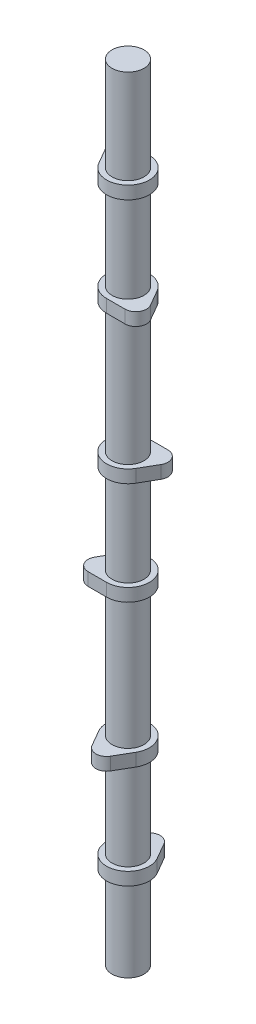
ISO-10303-21;
HEADER;
FILE_DESCRIPTION(('STEP AP214'),'2;1');
FILE_NAME('part.step','',(''),(''),'','','');
FILE_SCHEMA(('AUTOMOTIVE_DESIGN { 1 0 10303 214 1 1 1 1 }'));
ENDSEC;
DATA;
#1=APPLICATION_CONTEXT('core data for automotive mechanical design processes');
#2=APPLICATION_PROTOCOL_DEFINITION('international standard','automotive_design',2000,#1);
#3=PRODUCT_CONTEXT('',#1,'mechanical');
#4=PRODUCT('Part','Part','',(#3));
#5=PRODUCT_RELATED_PRODUCT_CATEGORY('part','',(#4));
#6=PRODUCT_DEFINITION_FORMATION('','',#4);
#7=PRODUCT_DEFINITION_CONTEXT('part definition',#1,'design');
#8=PRODUCT_DEFINITION('design','',#6,#7);
#9=PRODUCT_DEFINITION_SHAPE('','',#8);
#10=(LENGTH_UNIT() NAMED_UNIT(*) SI_UNIT(.MILLI.,.METRE.));
#11=(NAMED_UNIT(*) PLANE_ANGLE_UNIT() SI_UNIT($,.RADIAN.));
#12=(NAMED_UNIT(*) SI_UNIT($,.STERADIAN.) SOLID_ANGLE_UNIT());
#13=UNCERTAINTY_MEASURE_WITH_UNIT(LENGTH_MEASURE(1.E-05),#10,'distance_accuracy_value','');
#14=(GEOMETRIC_REPRESENTATION_CONTEXT(3) GLOBAL_UNCERTAINTY_ASSIGNED_CONTEXT((#13)) GLOBAL_UNIT_ASSIGNED_CONTEXT((#10,
#11,#12)) REPRESENTATION_CONTEXT('',''));
#15=CARTESIAN_POINT('',(0.,0.,0.));
#16=DIRECTION('',(0.,0.,1.));
#17=DIRECTION('',(1.,0.,0.));
#18=AXIS2_PLACEMENT_3D('',#15,#16,#17);
#19=CARTESIAN_POINT('',(-10.9985226280624,356.87,-6.34999999999997));
#20=DIRECTION('',(0.,-1.,0.));
#21=DIRECTION('',(-0.86602540378444,0.,-0.499999999999998));
#22=AXIS2_PLACEMENT_3D('',#19,#20,#21);
#23=CYLINDRICAL_SURFACE('',#22,6.35);
#24=CARTESIAN_POINT('',(-10.9985226280624,349.25,-6.34999999999997));
#25=DIRECTION('',(0.,1.,0.));
#26=DIRECTION('',(0.86602540378444,0.,0.499999999999998));
#27=AXIS2_PLACEMENT_3D('',#24,#25,#26);
#28=CIRCLE('',#27,6.35);
#29=CARTESIAN_POINT('',(-10.9985226280624,349.25,-12.7));
#30=VERTEX_POINT('',#29);
#31=CARTESIAN_POINT('',(-16.4977839420936,349.25,-3.17499999999996));
#32=VERTEX_POINT('',#31);
#33=EDGE_CURVE('E387',#30,#32,#28,.T.);
#34=ORIENTED_EDGE('',*,*,#33,.T.);
#35=DIRECTION('',(0.,-1.,0.));
#36=VECTOR('',#35,1.);
#37=CARTESIAN_POINT('',(-16.4977839420936,356.87,-3.17499999999996));
#38=LINE('',#37,#36);
#39=CARTESIAN_POINT('',(-16.4977839420936,356.87,-3.17499999999996));
#40=VERTEX_POINT('',#39);
#41=EDGE_CURVE('E406',#40,#32,#38,.T.);
#42=ORIENTED_EDGE('',*,*,#41,.F.);
#43=CARTESIAN_POINT('',(-10.9985226280624,356.87,-6.34999999999997));
#44=DIRECTION('',(0.,1.,0.));
#45=DIRECTION('',(0.86602540378444,0.,0.499999999999998));
#46=AXIS2_PLACEMENT_3D('',#43,#44,#45);
#47=CIRCLE('',#46,6.35);
#48=CARTESIAN_POINT('',(-10.9985226280624,356.87,-12.7));
#49=VERTEX_POINT('',#48);
#50=EDGE_CURVE('E388',#49,#40,#47,.T.);
#51=ORIENTED_EDGE('',*,*,#50,.F.);
#52=DIRECTION('',(0.,-1.,0.));
#53=VECTOR('',#52,1.);
#54=CARTESIAN_POINT('',(-10.9985226280624,356.87,-12.7));
#55=LINE('',#54,#53);
#56=EDGE_CURVE('E394',#49,#30,#55,.T.);
#57=ORIENTED_EDGE('',*,*,#56,.T.);
#58=EDGE_LOOP('',(#34,#42,#51,#57));
#59=FACE_BOUND('',#58,.T.);
#60=ADVANCED_FACE('F35',(#59),#23,.T.);
#61=CARTESIAN_POINT('',(-16.4977839420936,356.87,-3.17499999999996));
#62=DIRECTION('',(0.866025403784437,0.,-0.500000000000002));
#63=DIRECTION('',(-0.500000000000002,0.,-0.866025403784437));
#64=AXIS2_PLACEMENT_3D('',#61,#62,#63);
#65=PLANE('',#64);
#66=DIRECTION('',(0.500000000000002,0.,0.866025403784437));
#67=VECTOR('',#66,1.);
#68=CARTESIAN_POINT('',(-16.4977839420936,349.25,-3.17499999999996));
#69=LINE('',#68,#67);
#70=CARTESIAN_POINT('',(-10.9985226280624,349.25,6.35000000000003));
#71=VERTEX_POINT('',#70);
#72=EDGE_CURVE('E397',#32,#71,#69,.T.);
#73=ORIENTED_EDGE('',*,*,#72,.T.);
#74=DIRECTION('',(0.,-1.,0.));
#75=VECTOR('',#74,1.);
#76=CARTESIAN_POINT('',(-10.9985226280624,356.87,6.35000000000003));
#77=LINE('',#76,#75);
#78=CARTESIAN_POINT('',(-10.9985226280624,356.87,6.35000000000003));
#79=VERTEX_POINT('',#78);
#80=EDGE_CURVE('E404',#79,#71,#77,.T.);
#81=ORIENTED_EDGE('',*,*,#80,.F.);
#82=DIRECTION('',(0.500000000000002,0.,0.866025403784437));
#83=VECTOR('',#82,1.);
#84=CARTESIAN_POINT('',(-16.4977839420936,356.87,-3.17499999999996));
#85=LINE('',#84,#83);
#86=EDGE_CURVE('E84',#40,#79,#85,.T.);
#87=ORIENTED_EDGE('',*,*,#86,.F.);
#88=ORIENTED_EDGE('',*,*,#41,.T.);
#89=EDGE_LOOP('',(#73,#81,#87,#88));
#90=FACE_BOUND('',#89,.T.);
#91=ADVANCED_FACE('F425',(#90),#65,.F.);
#92=CARTESIAN_POINT('',(0.,356.87,0.));
#93=DIRECTION('',(0.,-1.,0.));
#94=DIRECTION('',(-0.86602540378444,0.,-0.499999999999998));
#95=AXIS2_PLACEMENT_3D('',#92,#93,#94);
#96=CYLINDRICAL_SURFACE('',#95,12.7);
#97=CARTESIAN_POINT('',(0.,349.25,0.));
#98=DIRECTION('',(0.,1.,0.));
#99=DIRECTION('',(0.86602540378444,0.,0.499999999999998));
#100=AXIS2_PLACEMENT_3D('',#97,#98,#99);
#101=CIRCLE('',#100,12.7);
#102=CARTESIAN_POINT('',(0.,349.25,-12.7));
#103=VERTEX_POINT('',#102);
#104=EDGE_CURVE('E70',#71,#103,#101,.T.);
#105=ORIENTED_EDGE('',*,*,#104,.T.);
#106=DIRECTION('',(0.,-1.,0.));
#107=VECTOR('',#106,1.);
#108=CARTESIAN_POINT('',(0.,356.87,-12.7));
#109=LINE('',#108,#107);
#110=CARTESIAN_POINT('',(0.,356.87,-12.7));
#111=VERTEX_POINT('',#110);
#112=EDGE_CURVE('E402',#111,#103,#109,.T.);
#113=ORIENTED_EDGE('',*,*,#112,.F.);
#114=CARTESIAN_POINT('',(0.,356.87,0.));
#115=DIRECTION('',(0.,1.,0.));
#116=DIRECTION('',(0.86602540378444,0.,0.499999999999998));
#117=AXIS2_PLACEMENT_3D('',#114,#115,#116);
#118=CIRCLE('',#117,12.7);
#119=EDGE_CURVE('E391',#79,#111,#118,.T.);
#120=ORIENTED_EDGE('',*,*,#119,.F.);
#121=ORIENTED_EDGE('',*,*,#80,.T.);
#122=EDGE_LOOP('',(#105,#113,#120,#121));
#123=FACE_BOUND('',#122,.T.);
#124=ADVANCED_FACE('F424',(#123),#96,.T.);
#125=CARTESIAN_POINT('',(-10.9985226280624,356.87,-12.7));
#126=DIRECTION('',(0.,0.,1.));
#127=DIRECTION('',(1.,0.,0.));
#128=AXIS2_PLACEMENT_3D('',#125,#126,#127);
#129=PLANE('',#128);
#130=DIRECTION('',(-1.,0.,0.));
#131=VECTOR('',#130,1.);
#132=CARTESIAN_POINT('',(-10.9985226280624,349.25,-12.7));
#133=LINE('',#132,#131);
#134=EDGE_CURVE('E76',#103,#30,#133,.T.);
#135=ORIENTED_EDGE('',*,*,#134,.T.);
#136=ORIENTED_EDGE('',*,*,#56,.F.);
#137=DIRECTION('',(-1.,0.,0.));
#138=VECTOR('',#137,1.);
#139=CARTESIAN_POINT('',(-10.9985226280624,356.87,-12.7));
#140=LINE('',#139,#138);
#141=EDGE_CURVE('E52',#111,#49,#140,.T.);
#142=ORIENTED_EDGE('',*,*,#141,.F.);
#143=ORIENTED_EDGE('',*,*,#112,.T.);
#144=EDGE_LOOP('',(#135,#136,#142,#143));
#145=FACE_BOUND('',#144,.T.);
#146=ADVANCED_FACE('F422',(#145),#129,.F.);
#147=CARTESIAN_POINT('',(-10.9985226280624,356.87,-6.34999999999997));
#148=DIRECTION('',(0.,1.,0.));
#149=DIRECTION('',(0.86602540378444,0.,0.499999999999998));
#150=AXIS2_PLACEMENT_3D('',#147,#148,#149);
#151=PLANE('',#150);
#152=CARTESIAN_POINT('',(0.,356.87,0.));
#153=DIRECTION('',(0.,1.,0.));
#154=DIRECTION('',(-0.866025403784443,0.,-0.499999999999992));
#155=AXIS2_PLACEMENT_3D('',#152,#153,#154);
#156=CIRCLE('',#155,9.5);
#157=CARTESIAN_POINT('',(-8.22724133595221,356.87,-4.74999999999992));
#158=VERTEX_POINT('',#157);
#159=EDGE_CURVE('E384',#158,#158,#156,.F.);
#160=ORIENTED_EDGE('',*,*,#159,.T.);
#161=EDGE_LOOP('',(#160));
#162=FACE_BOUND('',#161,.T.);
#163=ORIENTED_EDGE('',*,*,#50,.T.);
#164=ORIENTED_EDGE('',*,*,#86,.T.);
#165=ORIENTED_EDGE('',*,*,#119,.T.);
#166=ORIENTED_EDGE('',*,*,#141,.T.);
#167=EDGE_LOOP('',(#163,#164,#165,#166));
#168=FACE_BOUND('',#167,.T.);
#169=ADVANCED_FACE('F416',(#162,#168),#151,.T.);
#170=CARTESIAN_POINT('',(-10.9985226280624,349.25,-6.34999999999997));
#171=DIRECTION('',(0.,1.,0.));
#172=DIRECTION('',(0.86602540378444,0.,0.499999999999998));
#173=AXIS2_PLACEMENT_3D('',#170,#171,#172);
#174=PLANE('',#173);
#175=CARTESIAN_POINT('',(0.,349.25,0.));
#176=DIRECTION('',(0.,1.,0.));
#177=DIRECTION('',(-0.866025403784443,0.,-0.499999999999992));
#178=AXIS2_PLACEMENT_3D('',#175,#176,#177);
#179=CIRCLE('',#178,9.5);
#180=CARTESIAN_POINT('',(-8.22724133595221,349.25,-4.74999999999992));
#181=VERTEX_POINT('',#180);
#182=EDGE_CURVE('E44',#181,#181,#179,.F.);
#183=ORIENTED_EDGE('',*,*,#182,.F.);
#184=EDGE_LOOP('',(#183));
#185=FACE_BOUND('',#184,.T.);
#186=ORIENTED_EDGE('',*,*,#33,.F.);
#187=ORIENTED_EDGE('',*,*,#134,.F.);
#188=ORIENTED_EDGE('',*,*,#104,.F.);
#189=ORIENTED_EDGE('',*,*,#72,.F.);
#190=EDGE_LOOP('',(#186,#187,#188,#189));
#191=FACE_BOUND('',#190,.T.);
#192=ADVANCED_FACE('F413',(#185,#191),#174,.F.);
#193=CARTESIAN_POINT('',(0.,412.75,0.));
#194=DIRECTION('',(0.,-1.,0.));
#195=DIRECTION('',(0.866025403784443,0.,0.499999999999992));
#196=AXIS2_PLACEMENT_3D('',#193,#194,#195);
#197=CYLINDRICAL_SURFACE('',#196,9.5);
#198=CARTESIAN_POINT('',(0.,295.91,0.));
#199=DIRECTION('',(0.,1.,0.));
#200=DIRECTION('',(-0.866025403784443,0.,-0.499999999999992));
#201=AXIS2_PLACEMENT_3D('',#198,#199,#200);
#202=CIRCLE('',#201,9.5);
#203=CARTESIAN_POINT('',(-8.22724133595221,295.91,-4.74999999999992));
#204=VERTEX_POINT('',#203);
#205=EDGE_CURVE('E38',#204,#204,#202,.T.);
#206=ORIENTED_EDGE('',*,*,#205,.T.);
#207=EDGE_LOOP('',(#206));
#208=FACE_BOUND('',#207,.T.);
#209=ORIENTED_EDGE('',*,*,#182,.T.);
#210=EDGE_LOOP('',(#209));
#211=FACE_BOUND('',#210,.T.);
#212=ADVANCED_FACE('F411',(#208,#211),#197,.T.);
#213=ORIENTED_EDGE('',*,*,#159,.F.);
#214=EDGE_LOOP('',(#213));
#215=FACE_BOUND('',#214,.T.);
#216=CARTESIAN_POINT('',(0.,412.75,0.));
#217=DIRECTION('',(0.,1.,0.));
#218=DIRECTION('',(-0.866025403784443,0.,-0.499999999999992));
#219=AXIS2_PLACEMENT_3D('',#216,#217,#218);
#220=CIRCLE('',#219,9.5);
#221=CARTESIAN_POINT('',(-8.22724133595221,412.75,-4.74999999999992));
#222=VERTEX_POINT('',#221);
#223=EDGE_CURVE('E381',#222,#222,#220,.T.);
#224=ORIENTED_EDGE('',*,*,#223,.F.);
#225=EDGE_LOOP('',(#224));
#226=FACE_BOUND('',#225,.T.);
#227=ADVANCED_FACE('F438',(#215,#226),#197,.T.);
#228=CARTESIAN_POINT('',(0.,412.75,0.));
#229=DIRECTION('',(0.,1.,0.));
#230=DIRECTION('',(-0.866025403784443,0.,-0.499999999999992));
#231=AXIS2_PLACEMENT_3D('',#228,#229,#230);
#232=PLANE('',#231);
#233=ORIENTED_EDGE('',*,*,#223,.T.);
#234=EDGE_LOOP('',(#233));
#235=FACE_BOUND('',#234,.T.);
#236=ADVANCED_FACE('F441',(#235),#232,.T.);
#237=CARTESIAN_POINT('',(10.9985226280624,295.91,6.3499999999999));
#238=DIRECTION('',(0.,-1.,0.));
#239=DIRECTION('',(0.866025403784443,0.,0.499999999999992));
#240=AXIS2_PLACEMENT_3D('',#237,#238,#239);
#241=CYLINDRICAL_SURFACE('',#240,6.35);
#242=CARTESIAN_POINT('',(10.9985226280624,288.29,6.3499999999999));
#243=DIRECTION('',(0.,1.,0.));
#244=DIRECTION('',(-0.866025403784443,0.,-0.499999999999992));
#245=AXIS2_PLACEMENT_3D('',#242,#243,#244);
#246=CIRCLE('',#245,6.35);
#247=CARTESIAN_POINT('',(10.9985226280625,288.29,12.6999999999999));
#248=VERTEX_POINT('',#247);
#249=CARTESIAN_POINT('',(16.4977839420936,288.29,3.17499999999985));
#250=VERTEX_POINT('',#249);
#251=EDGE_CURVE('E349',#248,#250,#246,.T.);
#252=ORIENTED_EDGE('',*,*,#251,.T.);
#253=DIRECTION('',(0.,-1.,0.));
#254=VECTOR('',#253,1.);
#255=CARTESIAN_POINT('',(16.4977839420936,295.91,3.17499999999985));
#256=LINE('',#255,#254);
#257=CARTESIAN_POINT('',(16.4977839420936,295.91,3.17499999999985));
#258=VERTEX_POINT('',#257);
#259=EDGE_CURVE('E378',#258,#250,#256,.T.);
#260=ORIENTED_EDGE('',*,*,#259,.F.);
#261=CARTESIAN_POINT('',(10.9985226280624,295.91,6.3499999999999));
#262=DIRECTION('',(0.,1.,0.));
#263=DIRECTION('',(-0.866025403784443,0.,-0.499999999999992));
#264=AXIS2_PLACEMENT_3D('',#261,#262,#263);
#265=CIRCLE('',#264,6.35);
#266=CARTESIAN_POINT('',(10.9985226280625,295.91,12.6999999999999));
#267=VERTEX_POINT('',#266);
#268=EDGE_CURVE('E352',#267,#258,#265,.T.);
#269=ORIENTED_EDGE('',*,*,#268,.F.);
#270=DIRECTION('',(0.,-1.,0.));
#271=VECTOR('',#270,1.);
#272=CARTESIAN_POINT('',(10.9985226280625,295.91,12.6999999999999));
#273=LINE('',#272,#271);
#274=EDGE_CURVE('E362',#267,#248,#273,.T.);
#275=ORIENTED_EDGE('',*,*,#274,.T.);
#276=EDGE_LOOP('',(#252,#260,#269,#275));
#277=FACE_BOUND('',#276,.T.);
#278=ADVANCED_FACE('F446',(#277),#241,.T.);
#279=CARTESIAN_POINT('',(16.4977839420936,295.91,3.17499999999985));
#280=DIRECTION('',(-0.866025403784434,0.,0.500000000000008));
#281=DIRECTION('',(0.500000000000008,0.,0.866025403784434));
#282=AXIS2_PLACEMENT_3D('',#279,#280,#281);
#283=PLANE('',#282);
#284=DIRECTION('',(-0.500000000000008,0.,-0.866025403784434));
#285=VECTOR('',#284,1.);
#286=CARTESIAN_POINT('',(16.4977839420936,288.29,3.17499999999985));
#287=LINE('',#286,#285);
#288=CARTESIAN_POINT('',(10.9985226280623,288.29,-6.35000000000011));
#289=VERTEX_POINT('',#288);
#290=EDGE_CURVE('E365',#250,#289,#287,.T.);
#291=ORIENTED_EDGE('',*,*,#290,.T.);
#292=DIRECTION('',(0.,-1.,0.));
#293=VECTOR('',#292,1.);
#294=CARTESIAN_POINT('',(10.9985226280623,295.91,-6.35000000000011));
#295=LINE('',#294,#293);
#296=CARTESIAN_POINT('',(10.9985226280623,295.91,-6.35000000000011));
#297=VERTEX_POINT('',#296);
#298=EDGE_CURVE('E375',#297,#289,#295,.T.);
#299=ORIENTED_EDGE('',*,*,#298,.F.);
#300=DIRECTION('',(-0.500000000000008,0.,-0.866025403784434));
#301=VECTOR('',#300,1.);
#302=CARTESIAN_POINT('',(16.4977839420936,295.91,3.17499999999985));
#303=LINE('',#302,#301);
#304=EDGE_CURVE('E355',#258,#297,#303,.T.);
#305=ORIENTED_EDGE('',*,*,#304,.F.);
#306=ORIENTED_EDGE('',*,*,#259,.T.);
#307=EDGE_LOOP('',(#291,#299,#305,#306));
#308=FACE_BOUND('',#307,.T.);
#309=ADVANCED_FACE('F450',(#308),#283,.F.);
#310=CARTESIAN_POINT('',(0.,295.91,0.));
#311=DIRECTION('',(0.,-1.,0.));
#312=DIRECTION('',(0.866025403784443,0.,0.499999999999992));
#313=AXIS2_PLACEMENT_3D('',#310,#311,#312);
#314=CYLINDRICAL_SURFACE('',#313,12.7);
#315=CARTESIAN_POINT('',(0.,288.29,0.));
#316=DIRECTION('',(0.,1.,0.));
#317=DIRECTION('',(-0.866025403784443,0.,-0.499999999999992));
#318=AXIS2_PLACEMENT_3D('',#315,#316,#317);
#319=CIRCLE('',#318,12.7);
#320=CARTESIAN_POINT('',(1.16226472890446E-13,288.29,12.7));
#321=VERTEX_POINT('',#320);
#322=EDGE_CURVE('E367',#289,#321,#319,.T.);
#323=ORIENTED_EDGE('',*,*,#322,.T.);
#324=DIRECTION('',(0.,-1.,0.));
#325=VECTOR('',#324,1.);
#326=CARTESIAN_POINT('',(1.16226472890446E-13,295.91,12.7));
#327=LINE('',#326,#325);
#328=CARTESIAN_POINT('',(1.16226472890446E-13,295.91,12.7));
#329=VERTEX_POINT('',#328);
#330=EDGE_CURVE('E372',#329,#321,#327,.T.);
#331=ORIENTED_EDGE('',*,*,#330,.F.);
#332=CARTESIAN_POINT('',(0.,295.91,0.));
#333=DIRECTION('',(0.,1.,0.));
#334=DIRECTION('',(-0.866025403784443,0.,-0.499999999999992));
#335=AXIS2_PLACEMENT_3D('',#332,#333,#334);
#336=CIRCLE('',#335,12.7);
#337=EDGE_CURVE('E358',#297,#329,#336,.T.);
#338=ORIENTED_EDGE('',*,*,#337,.F.);
#339=ORIENTED_EDGE('',*,*,#298,.T.);
#340=EDGE_LOOP('',(#323,#331,#338,#339));
#341=FACE_BOUND('',#340,.T.);
#342=ADVANCED_FACE('F454',(#341),#314,.T.);
#343=CARTESIAN_POINT('',(10.9985226280625,295.91,12.6999999999999));
#344=DIRECTION('',(0.,0.,-1.));
#345=DIRECTION('',(-1.,0.,0.));
#346=AXIS2_PLACEMENT_3D('',#343,#344,#345);
#347=PLANE('',#346);
#348=DIRECTION('',(1.,0.,0.));
#349=VECTOR('',#348,1.);
#350=CARTESIAN_POINT('',(10.9985226280625,288.29,12.6999999999999));
#351=LINE('',#350,#349);
#352=EDGE_CURVE('E356',#321,#248,#351,.T.);
#353=ORIENTED_EDGE('',*,*,#352,.T.);
#354=ORIENTED_EDGE('',*,*,#274,.F.);
#355=DIRECTION('',(1.,0.,0.));
#356=VECTOR('',#355,1.);
#357=CARTESIAN_POINT('',(10.9985226280625,295.91,12.6999999999999));
#358=LINE('',#357,#356);
#359=EDGE_CURVE('E360',#329,#267,#358,.T.);
#360=ORIENTED_EDGE('',*,*,#359,.F.);
#361=ORIENTED_EDGE('',*,*,#330,.T.);
#362=EDGE_LOOP('',(#353,#354,#360,#361));
#363=FACE_BOUND('',#362,.T.);
#364=ADVANCED_FACE('F458',(#363),#347,.F.);
#365=CARTESIAN_POINT('',(10.9985226280624,295.91,6.3499999999999));
#366=DIRECTION('',(0.,1.,0.));
#367=DIRECTION('',(-0.866025403784443,0.,-0.499999999999992));
#368=AXIS2_PLACEMENT_3D('',#365,#366,#367);
#369=PLANE('',#368);
#370=ORIENTED_EDGE('',*,*,#205,.F.);
#371=EDGE_LOOP('',(#370));
#372=FACE_BOUND('',#371,.T.);
#373=ORIENTED_EDGE('',*,*,#268,.T.);
#374=ORIENTED_EDGE('',*,*,#304,.T.);
#375=ORIENTED_EDGE('',*,*,#337,.T.);
#376=ORIENTED_EDGE('',*,*,#359,.T.);
#377=EDGE_LOOP('',(#373,#374,#375,#376));
#378=FACE_BOUND('',#377,.T.);
#379=ADVANCED_FACE('F462',(#372,#378),#369,.T.);
#380=CARTESIAN_POINT('',(10.9985226280624,288.29,6.3499999999999));
#381=DIRECTION('',(0.,1.,0.));
#382=DIRECTION('',(-0.866025403784443,0.,-0.499999999999992));
#383=AXIS2_PLACEMENT_3D('',#380,#381,#382);
#384=PLANE('',#383);
#385=CARTESIAN_POINT('',(0.,288.29,0.));
#386=DIRECTION('',(0.,1.,0.));
#387=DIRECTION('',(-0.866025403784443,0.,-0.499999999999992));
#388=AXIS2_PLACEMENT_3D('',#385,#386,#387);
#389=CIRCLE('',#388,9.5);
#390=CARTESIAN_POINT('',(-8.22724133595221,288.29,-4.74999999999992));
#391=VERTEX_POINT('',#390);
#392=EDGE_CURVE('E11',#391,#391,#389,.T.);
#393=ORIENTED_EDGE('',*,*,#392,.T.);
#394=EDGE_LOOP('',(#393));
#395=FACE_BOUND('',#394,.T.);
#396=ORIENTED_EDGE('',*,*,#251,.F.);
#397=ORIENTED_EDGE('',*,*,#352,.F.);
#398=ORIENTED_EDGE('',*,*,#322,.F.);
#399=ORIENTED_EDGE('',*,*,#290,.F.);
#400=EDGE_LOOP('',(#396,#397,#398,#399));
#401=FACE_BOUND('',#400,.T.);
#402=ADVANCED_FACE('F464',(#395,#401),#384,.F.);
#403=ORIENTED_EDGE('',*,*,#392,.F.);
#404=EDGE_LOOP('',(#403));
#405=FACE_BOUND('',#404,.T.);
#406=CARTESIAN_POINT('',(0.,210.82,0.));
#407=DIRECTION('',(0.,1.,0.));
#408=DIRECTION('',(0.866025403784436,0.,-0.500000000000004));
#409=AXIS2_PLACEMENT_3D('',#406,#407,#408);
#410=CIRCLE('',#409,9.5);
#411=CARTESIAN_POINT('',(8.22724133595215,210.82,-4.75000000000004));
#412=VERTEX_POINT('',#411);
#413=EDGE_CURVE('E310',#412,#412,#410,.F.);
#414=ORIENTED_EDGE('',*,*,#413,.F.);
#415=EDGE_LOOP('',(#414));
#416=FACE_BOUND('',#415,.T.);
#417=ADVANCED_FACE('F443',(#405,#416),#197,.T.);
#418=CARTESIAN_POINT('',(10.9985226280624,210.82,-6.34999999999997));
#419=DIRECTION('',(0.,-1.,0.));
#420=DIRECTION('',(0.86602540378444,0.,-0.499999999999998));
#421=AXIS2_PLACEMENT_3D('',#418,#419,#420);
#422=CYLINDRICAL_SURFACE('',#421,6.35);
#423=CARTESIAN_POINT('',(10.9985226280624,203.2,-6.34999999999997));
#424=DIRECTION('',(0.,1.,0.));
#425=DIRECTION('',(-0.86602540378444,0.,0.499999999999998));
#426=AXIS2_PLACEMENT_3D('',#423,#424,#425);
#427=CIRCLE('',#426,6.35);
#428=CARTESIAN_POINT('',(16.4977839420936,203.2,-3.17499999999996));
#429=VERTEX_POINT('',#428);
#430=CARTESIAN_POINT('',(10.9985226280624,203.2,-12.7));
#431=VERTEX_POINT('',#430);
#432=EDGE_CURVE('E313',#429,#431,#427,.T.);
#433=ORIENTED_EDGE('',*,*,#432,.T.);
#434=DIRECTION('',(0.,-1.,0.));
#435=VECTOR('',#434,1.);
#436=CARTESIAN_POINT('',(10.9985226280624,210.82,-12.7));
#437=LINE('',#436,#435);
#438=CARTESIAN_POINT('',(10.9985226280624,210.82,-12.7));
#439=VERTEX_POINT('',#438);
#440=EDGE_CURVE('E340',#439,#431,#437,.T.);
#441=ORIENTED_EDGE('',*,*,#440,.F.);
#442=CARTESIAN_POINT('',(10.9985226280624,210.82,-6.34999999999997));
#443=DIRECTION('',(0.,1.,0.));
#444=DIRECTION('',(-0.86602540378444,0.,0.499999999999998));
#445=AXIS2_PLACEMENT_3D('',#442,#443,#444);
#446=CIRCLE('',#445,6.35);
#447=CARTESIAN_POINT('',(16.4977839420936,210.82,-3.17499999999996));
#448=VERTEX_POINT('',#447);
#449=EDGE_CURVE('E314',#448,#439,#446,.T.);
#450=ORIENTED_EDGE('',*,*,#449,.F.);
#451=DIRECTION('',(0.,-1.,0.));
#452=VECTOR('',#451,1.);
#453=CARTESIAN_POINT('',(16.4977839420936,210.82,-3.17499999999996));
#454=LINE('',#453,#452);
#455=EDGE_CURVE('E324',#448,#429,#454,.T.);
#456=ORIENTED_EDGE('',*,*,#455,.T.);
#457=EDGE_LOOP('',(#433,#441,#450,#456));
#458=FACE_BOUND('',#457,.T.);
#459=ADVANCED_FACE('F471',(#458),#422,.T.);
#460=CARTESIAN_POINT('',(10.9985226280624,210.82,-12.7));
#461=DIRECTION('',(0.,0.,1.));
#462=DIRECTION('',(1.,0.,0.));
#463=AXIS2_PLACEMENT_3D('',#460,#461,#462);
#464=PLANE('',#463);
#465=DIRECTION('',(-1.,0.,0.));
#466=VECTOR('',#465,1.);
#467=CARTESIAN_POINT('',(10.9985226280624,203.2,-12.7));
#468=LINE('',#467,#466);
#469=CARTESIAN_POINT('',(0.,203.2,-12.7));
#470=VERTEX_POINT('',#469);
#471=EDGE_CURVE('E327',#431,#470,#468,.T.);
#472=ORIENTED_EDGE('',*,*,#471,.T.);
#473=DIRECTION('',(0.,-1.,0.));
#474=VECTOR('',#473,1.);
#475=CARTESIAN_POINT('',(0.,210.82,-12.7));
#476=LINE('',#475,#474);
#477=CARTESIAN_POINT('',(0.,210.82,-12.7));
#478=VERTEX_POINT('',#477);
#479=EDGE_CURVE('E337',#478,#470,#476,.T.);
#480=ORIENTED_EDGE('',*,*,#479,.F.);
#481=DIRECTION('',(-1.,0.,0.));
#482=VECTOR('',#481,1.);
#483=CARTESIAN_POINT('',(10.9985226280624,210.82,-12.7));
#484=LINE('',#483,#482);
#485=EDGE_CURVE('E317',#439,#478,#484,.T.);
#486=ORIENTED_EDGE('',*,*,#485,.F.);
#487=ORIENTED_EDGE('',*,*,#440,.T.);
#488=EDGE_LOOP('',(#472,#480,#486,#487));
#489=FACE_BOUND('',#488,.T.);
#490=ADVANCED_FACE('F474',(#489),#464,.F.);
#491=CARTESIAN_POINT('',(0.,210.82,0.));
#492=DIRECTION('',(0.,-1.,0.));
#493=DIRECTION('',(0.86602540378444,0.,-0.499999999999998));
#494=AXIS2_PLACEMENT_3D('',#491,#492,#493);
#495=CYLINDRICAL_SURFACE('',#494,12.7);
#496=CARTESIAN_POINT('',(0.,203.2,0.));
#497=DIRECTION('',(0.,1.,0.));
#498=DIRECTION('',(-0.86602540378444,0.,0.499999999999998));
#499=AXIS2_PLACEMENT_3D('',#496,#497,#498);
#500=CIRCLE('',#499,12.7);
#501=CARTESIAN_POINT('',(10.9985226280624,203.2,6.35000000000003));
#502=VERTEX_POINT('',#501);
#503=EDGE_CURVE('E329',#470,#502,#500,.T.);
#504=ORIENTED_EDGE('',*,*,#503,.T.);
#505=DIRECTION('',(0.,-1.,0.));
#506=VECTOR('',#505,1.);
#507=CARTESIAN_POINT('',(10.9985226280624,210.82,6.35000000000003));
#508=LINE('',#507,#506);
#509=CARTESIAN_POINT('',(10.9985226280624,210.82,6.35000000000003));
#510=VERTEX_POINT('',#509);
#511=EDGE_CURVE('E334',#510,#502,#508,.T.);
#512=ORIENTED_EDGE('',*,*,#511,.F.);
#513=CARTESIAN_POINT('',(0.,210.82,0.));
#514=DIRECTION('',(0.,1.,0.));
#515=DIRECTION('',(-0.86602540378444,0.,0.499999999999998));
#516=AXIS2_PLACEMENT_3D('',#513,#514,#515);
#517=CIRCLE('',#516,12.7);
#518=EDGE_CURVE('E320',#478,#510,#517,.T.);
#519=ORIENTED_EDGE('',*,*,#518,.F.);
#520=ORIENTED_EDGE('',*,*,#479,.T.);
#521=EDGE_LOOP('',(#504,#512,#519,#520));
#522=FACE_BOUND('',#521,.T.);
#523=ADVANCED_FACE('F478',(#522),#495,.T.);
#524=CARTESIAN_POINT('',(16.4977839420936,210.82,-3.17499999999996));
#525=DIRECTION('',(-0.866025403784438,0.,-0.500000000000002));
#526=DIRECTION('',(-0.500000000000002,0.,0.866025403784438));
#527=AXIS2_PLACEMENT_3D('',#524,#525,#526);
#528=PLANE('',#527);
#529=DIRECTION('',(0.500000000000002,0.,-0.866025403784438));
#530=VECTOR('',#529,1.);
#531=CARTESIAN_POINT('',(16.4977839420936,203.2,-3.17499999999996));
#532=LINE('',#531,#530);
#533=EDGE_CURVE('E318',#502,#429,#532,.T.);
#534=ORIENTED_EDGE('',*,*,#533,.T.);
#535=ORIENTED_EDGE('',*,*,#455,.F.);
#536=DIRECTION('',(0.500000000000002,0.,-0.866025403784438));
#537=VECTOR('',#536,1.);
#538=CARTESIAN_POINT('',(16.4977839420936,210.82,-3.17499999999996));
#539=LINE('',#538,#537);
#540=EDGE_CURVE('E322',#510,#448,#539,.T.);
#541=ORIENTED_EDGE('',*,*,#540,.F.);
#542=ORIENTED_EDGE('',*,*,#511,.T.);
#543=EDGE_LOOP('',(#534,#535,#541,#542));
#544=FACE_BOUND('',#543,.T.);
#545=ADVANCED_FACE('F482',(#544),#528,.F.);
#546=CARTESIAN_POINT('',(10.9985226280624,210.82,-6.34999999999997));
#547=DIRECTION('',(0.,1.,0.));
#548=DIRECTION('',(-0.86602540378444,0.,0.499999999999998));
#549=AXIS2_PLACEMENT_3D('',#546,#547,#548);
#550=PLANE('',#549);
#551=ORIENTED_EDGE('',*,*,#413,.T.);
#552=EDGE_LOOP('',(#551));
#553=FACE_BOUND('',#552,.T.);
#554=ORIENTED_EDGE('',*,*,#449,.T.);
#555=ORIENTED_EDGE('',*,*,#485,.T.);
#556=ORIENTED_EDGE('',*,*,#518,.T.);
#557=ORIENTED_EDGE('',*,*,#540,.T.);
#558=EDGE_LOOP('',(#554,#555,#556,#557));
#559=FACE_BOUND('',#558,.T.);
#560=ADVANCED_FACE('F486',(#553,#559),#550,.T.);
#561=CARTESIAN_POINT('',(10.9985226280624,203.2,-6.34999999999997));
#562=DIRECTION('',(0.,1.,0.));
#563=DIRECTION('',(-0.86602540378444,0.,0.499999999999998));
#564=AXIS2_PLACEMENT_3D('',#561,#562,#563);
#565=PLANE('',#564);
#566=CARTESIAN_POINT('',(0.,203.2,0.));
#567=DIRECTION('',(0.,1.,0.));
#568=DIRECTION('',(0.866025403784436,0.,-0.500000000000004));
#569=AXIS2_PLACEMENT_3D('',#566,#567,#568);
#570=CIRCLE('',#569,9.5);
#571=CARTESIAN_POINT('',(8.22724133595215,203.2,-4.75000000000004));
#572=VERTEX_POINT('',#571);
#573=EDGE_CURVE('E343',#572,#572,#570,.F.);
#574=ORIENTED_EDGE('',*,*,#573,.F.);
#575=EDGE_LOOP('',(#574));
#576=FACE_BOUND('',#575,.T.);
#577=ORIENTED_EDGE('',*,*,#432,.F.);
#578=ORIENTED_EDGE('',*,*,#533,.F.);
#579=ORIENTED_EDGE('',*,*,#503,.F.);
#580=ORIENTED_EDGE('',*,*,#471,.F.);
#581=EDGE_LOOP('',(#577,#578,#579,#580));
#582=FACE_BOUND('',#581,.T.);
#583=ADVANCED_FACE('F488',(#576,#582),#565,.F.);
#584=CARTESIAN_POINT('',(0.,266.7,0.));
#585=DIRECTION('',(0.,-1.,0.));
#586=DIRECTION('',(-0.866025403784436,0.,0.500000000000004));
#587=AXIS2_PLACEMENT_3D('',#584,#585,#586);
#588=CYLINDRICAL_SURFACE('',#587,9.5);
#589=CARTESIAN_POINT('',(0.,149.86,0.));
#590=DIRECTION('',(0.,1.,0.));
#591=DIRECTION('',(0.866025403784436,0.,-0.500000000000004));
#592=AXIS2_PLACEMENT_3D('',#589,#590,#591);
#593=CIRCLE('',#592,9.5);
#594=CARTESIAN_POINT('',(8.22724133595215,149.86,-4.75000000000004));
#595=VERTEX_POINT('',#594);
#596=EDGE_CURVE('E309',#595,#595,#593,.T.);
#597=ORIENTED_EDGE('',*,*,#596,.T.);
#598=EDGE_LOOP('',(#597));
#599=FACE_BOUND('',#598,.T.);
#600=ORIENTED_EDGE('',*,*,#573,.T.);
#601=EDGE_LOOP('',(#600));
#602=FACE_BOUND('',#601,.T.);
#603=ADVANCED_FACE('F491',(#599,#602),#588,.T.);
#604=CARTESIAN_POINT('',(-10.9985226280623,149.86,6.35000000000005));
#605=DIRECTION('',(0.,-1.,0.));
#606=DIRECTION('',(-0.866025403784436,0.,0.500000000000004));
#607=AXIS2_PLACEMENT_3D('',#604,#605,#606);
#608=CYLINDRICAL_SURFACE('',#607,6.35);
#609=CARTESIAN_POINT('',(-10.9985226280623,142.24,6.35000000000005));
#610=DIRECTION('',(0.,1.,0.));
#611=DIRECTION('',(0.866025403784436,0.,-0.500000000000004));
#612=AXIS2_PLACEMENT_3D('',#609,#610,#611);
#613=CIRCLE('',#612,6.35);
#614=CARTESIAN_POINT('',(-16.4977839420935,142.24,3.17500000000008));
#615=VERTEX_POINT('',#614);
#616=CARTESIAN_POINT('',(-10.9985226280623,142.24,12.7000000000001));
#617=VERTEX_POINT('',#616);
#618=EDGE_CURVE('E278',#615,#617,#613,.T.);
#619=ORIENTED_EDGE('',*,*,#618,.T.);
#620=DIRECTION('',(0.,-1.,0.));
#621=VECTOR('',#620,1.);
#622=CARTESIAN_POINT('',(-10.9985226280623,149.86,12.7000000000001));
#623=LINE('',#622,#621);
#624=CARTESIAN_POINT('',(-10.9985226280623,149.86,12.7000000000001));
#625=VERTEX_POINT('',#624);
#626=EDGE_CURVE('E306',#625,#617,#623,.T.);
#627=ORIENTED_EDGE('',*,*,#626,.F.);
#628=CARTESIAN_POINT('',(-10.9985226280623,149.86,6.35000000000005));
#629=DIRECTION('',(0.,1.,0.));
#630=DIRECTION('',(0.866025403784436,0.,-0.500000000000004));
#631=AXIS2_PLACEMENT_3D('',#628,#629,#630);
#632=CIRCLE('',#631,6.35);
#633=CARTESIAN_POINT('',(-16.4977839420935,149.86,3.17500000000008));
#634=VERTEX_POINT('',#633);
#635=EDGE_CURVE('E280',#634,#625,#632,.T.);
#636=ORIENTED_EDGE('',*,*,#635,.F.);
#637=DIRECTION('',(0.,-1.,0.));
#638=VECTOR('',#637,1.);
#639=CARTESIAN_POINT('',(-16.4977839420935,149.86,3.17500000000008));
#640=LINE('',#639,#638);
#641=EDGE_CURVE('E290',#634,#615,#640,.T.);
#642=ORIENTED_EDGE('',*,*,#641,.T.);
#643=EDGE_LOOP('',(#619,#627,#636,#642));
#644=FACE_BOUND('',#643,.T.);
#645=ADVANCED_FACE('F502',(#644),#608,.T.);
#646=CARTESIAN_POINT('',(-10.9985226280623,149.86,12.7000000000001));
#647=DIRECTION('',(0.,0.,-1.));
#648=DIRECTION('',(-1.,0.,0.));
#649=AXIS2_PLACEMENT_3D('',#646,#647,#648);
#650=PLANE('',#649);
#651=DIRECTION('',(1.,0.,0.));
#652=VECTOR('',#651,1.);
#653=CARTESIAN_POINT('',(-10.9985226280623,142.24,12.7000000000001));
#654=LINE('',#653,#652);
#655=CARTESIAN_POINT('',(0.,142.24,12.7));
#656=VERTEX_POINT('',#655);
#657=EDGE_CURVE('E293',#617,#656,#654,.T.);
#658=ORIENTED_EDGE('',*,*,#657,.T.);
#659=DIRECTION('',(0.,-1.,0.));
#660=VECTOR('',#659,1.);
#661=CARTESIAN_POINT('',(0.,149.86,12.7));
#662=LINE('',#661,#660);
#663=CARTESIAN_POINT('',(0.,149.86,12.7));
#664=VERTEX_POINT('',#663);
#665=EDGE_CURVE('E303',#664,#656,#662,.T.);
#666=ORIENTED_EDGE('',*,*,#665,.F.);
#667=DIRECTION('',(1.,0.,0.));
#668=VECTOR('',#667,1.);
#669=CARTESIAN_POINT('',(-10.9985226280623,149.86,12.7000000000001));
#670=LINE('',#669,#668);
#671=EDGE_CURVE('E283',#625,#664,#670,.T.);
#672=ORIENTED_EDGE('',*,*,#671,.F.);
#673=ORIENTED_EDGE('',*,*,#626,.T.);
#674=EDGE_LOOP('',(#658,#666,#672,#673));
#675=FACE_BOUND('',#674,.T.);
#676=ADVANCED_FACE('F505',(#675),#650,.F.);
#677=CARTESIAN_POINT('',(0.,149.86,0.));
#678=DIRECTION('',(0.,-1.,0.));
#679=DIRECTION('',(-0.866025403784436,0.,0.500000000000004));
#680=AXIS2_PLACEMENT_3D('',#677,#678,#679);
#681=CYLINDRICAL_SURFACE('',#680,12.7);
#682=CARTESIAN_POINT('',(0.,142.24,0.));
#683=DIRECTION('',(0.,1.,0.));
#684=DIRECTION('',(0.866025403784436,0.,-0.500000000000004));
#685=AXIS2_PLACEMENT_3D('',#682,#683,#684);
#686=CIRCLE('',#685,12.7);
#687=CARTESIAN_POINT('',(-10.9985226280624,142.24,-6.34999999999995));
#688=VERTEX_POINT('',#687);
#689=EDGE_CURVE('E295',#656,#688,#686,.T.);
#690=ORIENTED_EDGE('',*,*,#689,.T.);
#691=DIRECTION('',(0.,-1.,0.));
#692=VECTOR('',#691,1.);
#693=CARTESIAN_POINT('',(-10.9985226280624,149.86,-6.34999999999995));
#694=LINE('',#693,#692);
#695=CARTESIAN_POINT('',(-10.9985226280624,149.86,-6.34999999999995));
#696=VERTEX_POINT('',#695);
#697=EDGE_CURVE('E300',#696,#688,#694,.T.);
#698=ORIENTED_EDGE('',*,*,#697,.F.);
#699=CARTESIAN_POINT('',(0.,149.86,0.));
#700=DIRECTION('',(0.,1.,0.));
#701=DIRECTION('',(0.866025403784436,0.,-0.500000000000004));
#702=AXIS2_PLACEMENT_3D('',#699,#700,#701);
#703=CIRCLE('',#702,12.7);
#704=EDGE_CURVE('E286',#664,#696,#703,.T.);
#705=ORIENTED_EDGE('',*,*,#704,.F.);
#706=ORIENTED_EDGE('',*,*,#665,.T.);
#707=EDGE_LOOP('',(#690,#698,#705,#706));
#708=FACE_BOUND('',#707,.T.);
#709=ADVANCED_FACE('F509',(#708),#681,.T.);
#710=CARTESIAN_POINT('',(-16.4977839420935,149.86,3.17500000000008));
#711=DIRECTION('',(0.866025403784441,0.,0.499999999999996));
#712=DIRECTION('',(0.499999999999996,0.,-0.866025403784441));
#713=AXIS2_PLACEMENT_3D('',#710,#711,#712);
#714=PLANE('',#713);
#715=DIRECTION('',(-0.499999999999996,0.,0.866025403784441));
#716=VECTOR('',#715,1.);
#717=CARTESIAN_POINT('',(-16.4977839420935,142.24,3.17500000000008));
#718=LINE('',#717,#716);
#719=EDGE_CURVE('E284',#688,#615,#718,.T.);
#720=ORIENTED_EDGE('',*,*,#719,.T.);
#721=ORIENTED_EDGE('',*,*,#641,.F.);
#722=DIRECTION('',(-0.499999999999996,0.,0.866025403784441));
#723=VECTOR('',#722,1.);
#724=CARTESIAN_POINT('',(-16.4977839420935,149.86,3.17500000000008));
#725=LINE('',#724,#723);
#726=EDGE_CURVE('E288',#696,#634,#725,.T.);
#727=ORIENTED_EDGE('',*,*,#726,.F.);
#728=ORIENTED_EDGE('',*,*,#697,.T.);
#729=EDGE_LOOP('',(#720,#721,#727,#728));
#730=FACE_BOUND('',#729,.T.);
#731=ADVANCED_FACE('F513',(#730),#714,.F.);
#732=CARTESIAN_POINT('',(-10.9985226280623,149.86,6.35000000000005));
#733=DIRECTION('',(0.,1.,0.));
#734=DIRECTION('',(0.866025403784436,0.,-0.500000000000004));
#735=AXIS2_PLACEMENT_3D('',#732,#733,#734);
#736=PLANE('',#735);
#737=ORIENTED_EDGE('',*,*,#596,.F.);
#738=EDGE_LOOP('',(#737));
#739=FACE_BOUND('',#738,.T.);
#740=ORIENTED_EDGE('',*,*,#635,.T.);
#741=ORIENTED_EDGE('',*,*,#671,.T.);
#742=ORIENTED_EDGE('',*,*,#704,.T.);
#743=ORIENTED_EDGE('',*,*,#726,.T.);
#744=EDGE_LOOP('',(#740,#741,#742,#743));
#745=FACE_BOUND('',#744,.T.);
#746=ADVANCED_FACE('F517',(#739,#745),#736,.T.);
#747=CARTESIAN_POINT('',(-10.9985226280623,142.24,6.35000000000005));
#748=DIRECTION('',(0.,1.,0.));
#749=DIRECTION('',(0.866025403784436,0.,-0.500000000000004));
#750=AXIS2_PLACEMENT_3D('',#747,#748,#749);
#751=PLANE('',#750);
#752=CARTESIAN_POINT('',(0.,142.24,0.));
#753=DIRECTION('',(0.,1.,0.));
#754=DIRECTION('',(0.866025403784436,0.,-0.500000000000004));
#755=AXIS2_PLACEMENT_3D('',#752,#753,#754);
#756=CIRCLE('',#755,9.5);
#757=CARTESIAN_POINT('',(8.22724133595215,142.24,-4.75000000000004));
#758=VERTEX_POINT('',#757);
#759=EDGE_CURVE('E346',#758,#758,#756,.T.);
#760=ORIENTED_EDGE('',*,*,#759,.T.);
#761=EDGE_LOOP('',(#760));
#762=FACE_BOUND('',#761,.T.);
#763=ORIENTED_EDGE('',*,*,#618,.F.);
#764=ORIENTED_EDGE('',*,*,#719,.F.);
#765=ORIENTED_EDGE('',*,*,#689,.F.);
#766=ORIENTED_EDGE('',*,*,#657,.F.);
#767=EDGE_LOOP('',(#763,#764,#765,#766));
#768=FACE_BOUND('',#767,.T.);
#769=ADVANCED_FACE('F500',(#762,#768),#751,.F.);
#770=ORIENTED_EDGE('',*,*,#759,.F.);
#771=EDGE_LOOP('',(#770));
#772=FACE_BOUND('',#771,.T.);
#773=CARTESIAN_POINT('',(0.,64.77,0.));
#774=DIRECTION('',(0.,1.,0.));
#775=DIRECTION('',(0.,0.,1.));
#776=AXIS2_PLACEMENT_3D('',#773,#774,#775);
#777=CIRCLE('',#776,9.5);
#778=CARTESIAN_POINT('',(0.,64.77,9.5));
#779=VERTEX_POINT('',#778);
#780=EDGE_CURVE('E235',#779,#779,#777,.F.);
#781=ORIENTED_EDGE('',*,*,#780,.F.);
#782=EDGE_LOOP('',(#781));
#783=FACE_BOUND('',#782,.T.);
#784=ADVANCED_FACE('F496',(#772,#783),#588,.T.);
#785=CARTESIAN_POINT('',(0.,64.77,12.7));
#786=DIRECTION('',(0.,-1.,0.));
#787=DIRECTION('',(0.,0.,1.));
#788=AXIS2_PLACEMENT_3D('',#785,#786,#787);
#789=CYLINDRICAL_SURFACE('',#788,6.35);
#790=CARTESIAN_POINT('',(0.,57.15,12.7));
#791=DIRECTION('',(0.,1.,0.));
#792=DIRECTION('',(0.,0.,-1.));
#793=AXIS2_PLACEMENT_3D('',#790,#791,#792);
#794=CIRCLE('',#793,6.35);
#795=CARTESIAN_POINT('',(-5.4992613140313,57.15,15.875));
#796=VERTEX_POINT('',#795);
#797=CARTESIAN_POINT('',(5.49926131403107,57.15,15.875));
#798=VERTEX_POINT('',#797);
#799=EDGE_CURVE('E243',#796,#798,#794,.T.);
#800=ORIENTED_EDGE('',*,*,#799,.T.);
#801=DIRECTION('',(0.,-1.,0.));
#802=VECTOR('',#801,1.);
#803=CARTESIAN_POINT('',(5.49926131403107,64.77,15.875));
#804=LINE('',#803,#802);
#805=CARTESIAN_POINT('',(5.49926131403107,64.77,15.875));
#806=VERTEX_POINT('',#805);
#807=EDGE_CURVE('E270',#806,#798,#804,.T.);
#808=ORIENTED_EDGE('',*,*,#807,.F.);
#809=CARTESIAN_POINT('',(0.,64.77,12.7));
#810=DIRECTION('',(0.,1.,0.));
#811=DIRECTION('',(0.,0.,-1.));
#812=AXIS2_PLACEMENT_3D('',#809,#810,#811);
#813=CIRCLE('',#812,6.35);
#814=CARTESIAN_POINT('',(-5.4992613140313,64.77,15.875));
#815=VERTEX_POINT('',#814);
#816=EDGE_CURVE('E244',#815,#806,#813,.T.);
#817=ORIENTED_EDGE('',*,*,#816,.F.);
#818=DIRECTION('',(0.,-1.,0.));
#819=VECTOR('',#818,1.);
#820=CARTESIAN_POINT('',(-5.4992613140313,64.77,15.875));
#821=LINE('',#820,#819);
#822=EDGE_CURVE('E254',#815,#796,#821,.T.);
#823=ORIENTED_EDGE('',*,*,#822,.T.);
#824=EDGE_LOOP('',(#800,#808,#817,#823));
#825=FACE_BOUND('',#824,.T.);
#826=ADVANCED_FACE('F499',(#825),#789,.T.);
#827=CARTESIAN_POINT('',(5.49926131403107,64.77,15.875));
#828=DIRECTION('',(-0.866025403784435,0.,-0.500000000000006));
#829=DIRECTION('',(-0.500000000000006,0.,0.866025403784435));
#830=AXIS2_PLACEMENT_3D('',#827,#828,#829);
#831=PLANE('',#830);
#832=DIRECTION('',(0.500000000000006,0.,-0.866025403784435));
#833=VECTOR('',#832,1.);
#834=CARTESIAN_POINT('',(5.49926131403107,57.15,15.875));
#835=LINE('',#834,#833);
#836=CARTESIAN_POINT('',(10.9985226280623,57.15,6.35000000000007));
#837=VERTEX_POINT('',#836);
#838=EDGE_CURVE('E257',#798,#837,#835,.T.);
#839=ORIENTED_EDGE('',*,*,#838,.T.);
#840=DIRECTION('',(0.,-1.,0.));
#841=VECTOR('',#840,1.);
#842=CARTESIAN_POINT('',(10.9985226280623,64.77,6.35000000000007));
#843=LINE('',#842,#841);
#844=CARTESIAN_POINT('',(10.9985226280623,64.77,6.35000000000007));
#845=VERTEX_POINT('',#844);
#846=EDGE_CURVE('E267',#845,#837,#843,.T.);
#847=ORIENTED_EDGE('',*,*,#846,.F.);
#848=DIRECTION('',(0.500000000000006,0.,-0.866025403784435));
#849=VECTOR('',#848,1.);
#850=CARTESIAN_POINT('',(5.49926131403107,64.77,15.875));
#851=LINE('',#850,#849);
#852=EDGE_CURVE('E247',#806,#845,#851,.T.);
#853=ORIENTED_EDGE('',*,*,#852,.F.);
#854=ORIENTED_EDGE('',*,*,#807,.T.);
#855=EDGE_LOOP('',(#839,#847,#853,#854));
#856=FACE_BOUND('',#855,.T.);
#857=ADVANCED_FACE('F527',(#856),#831,.F.);
#858=CARTESIAN_POINT('',(0.,64.77,0.));
#859=DIRECTION('',(0.,-1.,0.));
#860=DIRECTION('',(0.,0.,1.));
#861=AXIS2_PLACEMENT_3D('',#858,#859,#860);
#862=CYLINDRICAL_SURFACE('',#861,12.7);
#863=CARTESIAN_POINT('',(0.,57.15,0.));
#864=DIRECTION('',(0.,1.,0.));
#865=DIRECTION('',(0.,0.,-1.));
#866=AXIS2_PLACEMENT_3D('',#863,#864,#865);
#867=CIRCLE('',#866,12.7);
#868=CARTESIAN_POINT('',(-10.9985226280624,57.15,6.34999999999992));
#869=VERTEX_POINT('',#868);
#870=EDGE_CURVE('E259',#837,#869,#867,.T.);
#871=ORIENTED_EDGE('',*,*,#870,.T.);
#872=DIRECTION('',(0.,-1.,0.));
#873=VECTOR('',#872,1.);
#874=CARTESIAN_POINT('',(-10.9985226280624,64.77,6.34999999999992));
#875=LINE('',#874,#873);
#876=CARTESIAN_POINT('',(-10.9985226280624,64.77,6.34999999999992));
#877=VERTEX_POINT('',#876);
#878=EDGE_CURVE('E264',#877,#869,#875,.T.);
#879=ORIENTED_EDGE('',*,*,#878,.F.);
#880=CARTESIAN_POINT('',(0.,64.77,0.));
#881=DIRECTION('',(0.,1.,0.));
#882=DIRECTION('',(0.,0.,-1.));
#883=AXIS2_PLACEMENT_3D('',#880,#881,#882);
#884=CIRCLE('',#883,12.7);
#885=EDGE_CURVE('E250',#845,#877,#884,.T.);
#886=ORIENTED_EDGE('',*,*,#885,.F.);
#887=ORIENTED_EDGE('',*,*,#846,.T.);
#888=EDGE_LOOP('',(#871,#879,#886,#887));
#889=FACE_BOUND('',#888,.T.);
#890=ADVANCED_FACE('F531',(#889),#862,.T.);
#891=CARTESIAN_POINT('',(-5.4992613140313,64.77,15.875));
#892=DIRECTION('',(0.866025403784442,0.,-0.499999999999994));
#893=DIRECTION('',(-0.499999999999994,0.,-0.866025403784442));
#894=AXIS2_PLACEMENT_3D('',#891,#892,#893);
#895=PLANE('',#894);
#896=DIRECTION('',(0.499999999999994,0.,0.866025403784442));
#897=VECTOR('',#896,1.);
#898=CARTESIAN_POINT('',(-5.4992613140313,57.15,15.875));
#899=LINE('',#898,#897);
#900=EDGE_CURVE('E248',#869,#796,#899,.T.);
#901=ORIENTED_EDGE('',*,*,#900,.T.);
#902=ORIENTED_EDGE('',*,*,#822,.F.);
#903=DIRECTION('',(0.499999999999994,0.,0.866025403784442));
#904=VECTOR('',#903,1.);
#905=CARTESIAN_POINT('',(-5.4992613140313,64.77,15.875));
#906=LINE('',#905,#904);
#907=EDGE_CURVE('E252',#877,#815,#906,.T.);
#908=ORIENTED_EDGE('',*,*,#907,.F.);
#909=ORIENTED_EDGE('',*,*,#878,.T.);
#910=EDGE_LOOP('',(#901,#902,#908,#909));
#911=FACE_BOUND('',#910,.T.);
#912=ADVANCED_FACE('F535',(#911),#895,.F.);
#913=CARTESIAN_POINT('',(0.,64.77,12.7));
#914=DIRECTION('',(0.,1.,0.));
#915=DIRECTION('',(0.,0.,-1.));
#916=AXIS2_PLACEMENT_3D('',#913,#914,#915);
#917=PLANE('',#916);
#918=ORIENTED_EDGE('',*,*,#780,.T.);
#919=EDGE_LOOP('',(#918));
#920=FACE_BOUND('',#919,.T.);
#921=ORIENTED_EDGE('',*,*,#816,.T.);
#922=ORIENTED_EDGE('',*,*,#852,.T.);
#923=ORIENTED_EDGE('',*,*,#885,.T.);
#924=ORIENTED_EDGE('',*,*,#907,.T.);
#925=EDGE_LOOP('',(#921,#922,#923,#924));
#926=FACE_BOUND('',#925,.T.);
#927=ADVANCED_FACE('F539',(#920,#926),#917,.T.);
#928=CARTESIAN_POINT('',(0.,57.15,12.7));
#929=DIRECTION('',(0.,1.,0.));
#930=DIRECTION('',(0.,0.,-1.));
#931=AXIS2_PLACEMENT_3D('',#928,#929,#930);
#932=PLANE('',#931);
#933=CARTESIAN_POINT('',(0.,57.15,0.));
#934=DIRECTION('',(0.,1.,0.));
#935=DIRECTION('',(0.,0.,1.));
#936=AXIS2_PLACEMENT_3D('',#933,#934,#935);
#937=CIRCLE('',#936,9.5);
#938=CARTESIAN_POINT('',(0.,57.15,9.5));
#939=VERTEX_POINT('',#938);
#940=EDGE_CURVE('E273',#939,#939,#937,.F.);
#941=ORIENTED_EDGE('',*,*,#940,.F.);
#942=EDGE_LOOP('',(#941));
#943=FACE_BOUND('',#942,.T.);
#944=ORIENTED_EDGE('',*,*,#799,.F.);
#945=ORIENTED_EDGE('',*,*,#900,.F.);
#946=ORIENTED_EDGE('',*,*,#870,.F.);
#947=ORIENTED_EDGE('',*,*,#838,.F.);
#948=EDGE_LOOP('',(#944,#945,#946,#947));
#949=FACE_BOUND('',#948,.T.);
#950=ADVANCED_FACE('F541',(#943,#949),#932,.F.);
#951=CARTESIAN_POINT('',(0.,120.65,0.));
#952=DIRECTION('',(0.,-1.,0.));
#953=DIRECTION('',(0.,0.,-1.));
#954=AXIS2_PLACEMENT_3D('',#951,#952,#953);
#955=CYLINDRICAL_SURFACE('',#954,9.5);
#956=CARTESIAN_POINT('',(0.,3.80999999999999,0.));
#957=DIRECTION('',(0.,1.,0.));
#958=DIRECTION('',(0.,0.,1.));
#959=AXIS2_PLACEMENT_3D('',#956,#957,#958);
#960=CIRCLE('',#959,9.5);
#961=CARTESIAN_POINT('',(0.,3.80999999999999,9.5));
#962=VERTEX_POINT('',#961);
#963=EDGE_CURVE('E232',#962,#962,#960,.T.);
#964=ORIENTED_EDGE('',*,*,#963,.T.);
#965=EDGE_LOOP('',(#964));
#966=FACE_BOUND('',#965,.T.);
#967=ORIENTED_EDGE('',*,*,#940,.T.);
#968=EDGE_LOOP('',(#967));
#969=FACE_BOUND('',#968,.T.);
#970=ADVANCED_FACE('F544',(#966,#969),#955,.T.);
#971=CARTESIAN_POINT('',(0.,3.81,-12.7));
#972=DIRECTION('',(0.,-1.,0.));
#973=DIRECTION('',(0.,0.,-1.));
#974=AXIS2_PLACEMENT_3D('',#971,#972,#973);
#975=CYLINDRICAL_SURFACE('',#974,6.35);
#976=CARTESIAN_POINT('',(0.,-3.81,-12.7));
#977=DIRECTION('',(0.,1.,0.));
#978=DIRECTION('',(0.,0.,1.));
#979=AXIS2_PLACEMENT_3D('',#976,#977,#978);
#980=CIRCLE('',#979,6.35);
#981=CARTESIAN_POINT('',(5.49926131403118,-3.81,-15.875));
#982=VERTEX_POINT('',#981);
#983=CARTESIAN_POINT('',(-5.49926131403119,-3.81,-15.875));
#984=VERTEX_POINT('',#983);
#985=EDGE_CURVE('E231',#982,#984,#980,.T.);
#986=ORIENTED_EDGE('',*,*,#985,.T.);
#987=DIRECTION('',(0.,-1.,0.));
#988=VECTOR('',#987,1.);
#989=CARTESIAN_POINT('',(-5.49926131403119,3.81,-15.875));
#990=LINE('',#989,#988);
#991=CARTESIAN_POINT('',(-5.49926131403119,3.81,-15.875));
#992=VERTEX_POINT('',#991);
#993=EDGE_CURVE('E211',#992,#984,#990,.T.);
#994=ORIENTED_EDGE('',*,*,#993,.F.);
#995=CARTESIAN_POINT('',(0.,3.81,-12.7));
#996=DIRECTION('',(0.,1.,0.));
#997=DIRECTION('',(0.,0.,1.));
#998=AXIS2_PLACEMENT_3D('',#995,#996,#997);
#999=CIRCLE('',#998,6.35);
#1000=CARTESIAN_POINT('',(5.49926131403118,3.81,-15.875));
#1001=VERTEX_POINT('',#1000);
#1002=EDGE_CURVE('E218',#1001,#992,#999,.T.);
#1003=ORIENTED_EDGE('',*,*,#1002,.F.);
#1004=DIRECTION('',(0.,-1.,0.));
#1005=VECTOR('',#1004,1.);
#1006=CARTESIAN_POINT('',(5.49926131403118,3.81,-15.875));
#1007=LINE('',#1006,#1005);
#1008=EDGE_CURVE('E586',#1001,#982,#1007,.T.);
#1009=ORIENTED_EDGE('',*,*,#1008,.T.);
#1010=EDGE_LOOP('',(#986,#994,#1003,#1009));
#1011=FACE_BOUND('',#1010,.T.);
#1012=ADVANCED_FACE('F229',(#1011),#975,.T.);
#1013=CARTESIAN_POINT('',(-5.49926131403119,3.81,-15.875));
#1014=DIRECTION('',(0.866025403784439,0.,0.5));
#1015=DIRECTION('',(0.5,0.,-0.866025403784439));
#1016=AXIS2_PLACEMENT_3D('',#1013,#1014,#1015);
#1017=PLANE('',#1016);
#1018=DIRECTION('',(-0.5,0.,0.866025403784439));
#1019=VECTOR('',#1018,1.);
#1020=CARTESIAN_POINT('',(-5.49926131403119,-3.81,-15.875));
#1021=LINE('',#1020,#1019);
#1022=CARTESIAN_POINT('',(-10.9985226280624,-3.81,-6.34999999999999));
#1023=VERTEX_POINT('',#1022);
#1024=EDGE_CURVE('E582',#984,#1023,#1021,.T.);
#1025=ORIENTED_EDGE('',*,*,#1024,.T.);
#1026=DIRECTION('',(0.,-1.,0.));
#1027=VECTOR('',#1026,1.);
#1028=CARTESIAN_POINT('',(-10.9985226280624,3.81,-6.34999999999999));
#1029=LINE('',#1028,#1027);
#1030=CARTESIAN_POINT('',(-10.9985226280624,3.81,-6.34999999999999));
#1031=VERTEX_POINT('',#1030);
#1032=EDGE_CURVE('E214',#1031,#1023,#1029,.T.);
#1033=ORIENTED_EDGE('',*,*,#1032,.F.);
#1034=DIRECTION('',(-0.5,0.,0.866025403784439));
#1035=VECTOR('',#1034,1.);
#1036=CARTESIAN_POINT('',(-5.49926131403119,3.81,-15.875));
#1037=LINE('',#1036,#1035);
#1038=EDGE_CURVE('E207',#992,#1031,#1037,.T.);
#1039=ORIENTED_EDGE('',*,*,#1038,.F.);
#1040=ORIENTED_EDGE('',*,*,#993,.T.);
#1041=EDGE_LOOP('',(#1025,#1033,#1039,#1040));
#1042=FACE_BOUND('',#1041,.T.);
#1043=ADVANCED_FACE('F209',(#1042),#1017,.F.);
#1044=CARTESIAN_POINT('',(0.,3.81,0.));
#1045=DIRECTION('',(0.,-1.,0.));
#1046=DIRECTION('',(0.,0.,-1.));
#1047=AXIS2_PLACEMENT_3D('',#1044,#1045,#1046);
#1048=CYLINDRICAL_SURFACE('',#1047,12.7);
#1049=CARTESIAN_POINT('',(0.,-3.81,0.));
#1050=DIRECTION('',(0.,1.,0.));
#1051=DIRECTION('',(0.,0.,1.));
#1052=AXIS2_PLACEMENT_3D('',#1049,#1050,#1051);
#1053=CIRCLE('',#1052,12.7);
#1054=CARTESIAN_POINT('',(10.9985226280624,-3.81,-6.35));
#1055=VERTEX_POINT('',#1054);
#1056=EDGE_CURVE('E589',#1023,#1055,#1053,.T.);
#1057=ORIENTED_EDGE('',*,*,#1056,.T.);
#1058=DIRECTION('',(0.,-1.,0.));
#1059=VECTOR('',#1058,1.);
#1060=CARTESIAN_POINT('',(10.9985226280624,3.81,-6.35));
#1061=LINE('',#1060,#1059);
#1062=CARTESIAN_POINT('',(10.9985226280624,3.81,-6.35));
#1063=VERTEX_POINT('',#1062);
#1064=EDGE_CURVE('E237',#1063,#1055,#1061,.T.);
#1065=ORIENTED_EDGE('',*,*,#1064,.F.);
#1066=CARTESIAN_POINT('',(0.,3.81,0.));
#1067=DIRECTION('',(0.,1.,0.));
#1068=DIRECTION('',(0.,0.,1.));
#1069=AXIS2_PLACEMENT_3D('',#1066,#1067,#1068);
#1070=CIRCLE('',#1069,12.7);
#1071=EDGE_CURVE('E217',#1031,#1063,#1070,.T.);
#1072=ORIENTED_EDGE('',*,*,#1071,.F.);
#1073=ORIENTED_EDGE('',*,*,#1032,.T.);
#1074=EDGE_LOOP('',(#1057,#1065,#1072,#1073));
#1075=FACE_BOUND('',#1074,.T.);
#1076=ADVANCED_FACE('F559',(#1075),#1048,.T.);
#1077=CARTESIAN_POINT('',(5.49926131403118,3.81,-15.875));
#1078=DIRECTION('',(-0.866025403784439,0.,0.5));
#1079=DIRECTION('',(0.5,0.,0.866025403784439));
#1080=AXIS2_PLACEMENT_3D('',#1077,#1078,#1079);
#1081=PLANE('',#1080);
#1082=DIRECTION('',(-0.5,0.,-0.866025403784439));
#1083=VECTOR('',#1082,1.);
#1084=CARTESIAN_POINT('',(5.49926131403118,-3.81,-15.875));
#1085=LINE('',#1084,#1083);
#1086=EDGE_CURVE('E227',#1055,#982,#1085,.T.);
#1087=ORIENTED_EDGE('',*,*,#1086,.T.);
#1088=ORIENTED_EDGE('',*,*,#1008,.F.);
#1089=DIRECTION('',(-0.5,0.,-0.866025403784439));
#1090=VECTOR('',#1089,1.);
#1091=CARTESIAN_POINT('',(5.49926131403118,3.81,-15.875));
#1092=LINE('',#1091,#1090);
#1093=EDGE_CURVE('E223',#1063,#1001,#1092,.T.);
#1094=ORIENTED_EDGE('',*,*,#1093,.F.);
#1095=ORIENTED_EDGE('',*,*,#1064,.T.);
#1096=EDGE_LOOP('',(#1087,#1088,#1094,#1095));
#1097=FACE_BOUND('',#1096,.T.);
#1098=ADVANCED_FACE('F562',(#1097),#1081,.F.);
#1099=CARTESIAN_POINT('',(0.,3.81,-12.7));
#1100=DIRECTION('',(0.,1.,0.));
#1101=DIRECTION('',(0.,0.,1.));
#1102=AXIS2_PLACEMENT_3D('',#1099,#1100,#1101);
#1103=PLANE('',#1102);
#1104=ORIENTED_EDGE('',*,*,#963,.F.);
#1105=EDGE_LOOP('',(#1104));
#1106=FACE_BOUND('',#1105,.T.);
#1107=ORIENTED_EDGE('',*,*,#1002,.T.);
#1108=ORIENTED_EDGE('',*,*,#1038,.T.);
#1109=ORIENTED_EDGE('',*,*,#1071,.T.);
#1110=ORIENTED_EDGE('',*,*,#1093,.T.);
#1111=EDGE_LOOP('',(#1107,#1108,#1109,#1110));
#1112=FACE_BOUND('',#1111,.T.);
#1113=ADVANCED_FACE('F221',(#1106,#1112),#1103,.T.);
#1114=CARTESIAN_POINT('',(0.,-3.81,-12.7));
#1115=DIRECTION('',(0.,1.,0.));
#1116=DIRECTION('',(0.,0.,1.));
#1117=AXIS2_PLACEMENT_3D('',#1114,#1115,#1116);
#1118=PLANE('',#1117);
#1119=CARTESIAN_POINT('',(0.,-3.80999999999999,0.));
#1120=DIRECTION('',(0.,1.,0.));
#1121=DIRECTION('',(0.,0.,1.));
#1122=AXIS2_PLACEMENT_3D('',#1119,#1120,#1121);
#1123=CIRCLE('',#1122,9.5);
#1124=CARTESIAN_POINT('',(0.,-3.80999999999999,9.5));
#1125=VERTEX_POINT('',#1124);
#1126=EDGE_CURVE('E276',#1125,#1125,#1123,.T.);
#1127=ORIENTED_EDGE('',*,*,#1126,.T.);
#1128=EDGE_LOOP('',(#1127));
#1129=FACE_BOUND('',#1128,.T.);
#1130=ORIENTED_EDGE('',*,*,#985,.F.);
#1131=ORIENTED_EDGE('',*,*,#1086,.F.);
#1132=ORIENTED_EDGE('',*,*,#1056,.F.);
#1133=ORIENTED_EDGE('',*,*,#1024,.F.);
#1134=EDGE_LOOP('',(#1130,#1131,#1132,#1133));
#1135=FACE_BOUND('',#1134,.T.);
#1136=ADVANCED_FACE('F553',(#1129,#1135),#1118,.F.);
#1137=ORIENTED_EDGE('',*,*,#1126,.F.);
#1138=EDGE_LOOP('',(#1137));
#1139=FACE_BOUND('',#1138,.T.);
#1140=CARTESIAN_POINT('',(0.,-53.34,0.));
#1141=DIRECTION('',(0.,-1.,0.));
#1142=DIRECTION('',(0.,0.,-1.));
#1143=AXIS2_PLACEMENT_3D('',#1140,#1141,#1142);
#1144=CIRCLE('',#1143,9.5);
#1145=CARTESIAN_POINT('',(0.,-53.34,-9.5));
#1146=VERTEX_POINT('',#1145);
#1147=EDGE_CURVE('E579',#1146,#1146,#1144,.T.);
#1148=ORIENTED_EDGE('',*,*,#1147,.F.);
#1149=EDGE_LOOP('',(#1148));
#1150=FACE_BOUND('',#1149,.T.);
#1151=ADVANCED_FACE('F549',(#1139,#1150),#955,.T.);
#1152=CARTESIAN_POINT('',(0.,-53.34,0.));
#1153=DIRECTION('',(0.,-1.,0.));
#1154=DIRECTION('',(0.,0.,-1.));
#1155=AXIS2_PLACEMENT_3D('',#1152,#1153,#1154);
#1156=PLANE('',#1155);
#1157=ORIENTED_EDGE('',*,*,#1147,.T.);
#1158=EDGE_LOOP('',(#1157));
#1159=FACE_BOUND('',#1158,.T.);
#1160=ADVANCED_FACE('F552',(#1159),#1156,.T.);
#1161=CLOSED_SHELL('',(#60,#91,#124,#146,#169,#192,#212,#227,#236,#278,#309,#342,#364,#379,#402,
#417,#459,#490,#523,#545,#560,#583,#603,#645,#676,#709,#731,#746,#769,#784,#826,#857,#890,#912,
#927,#950,#970,#1012,#1043,#1076,#1098,#1113,#1136,#1151,#1160));
#1162=MANIFOLD_SOLID_BREP('B2',#1161);
#1163=ADVANCED_BREP_SHAPE_REPRESENTATION('',(#18,#1162),#14);
#1164=SHAPE_DEFINITION_REPRESENTATION(#9,#1163);
ENDSEC;
END-ISO-10303-21;
